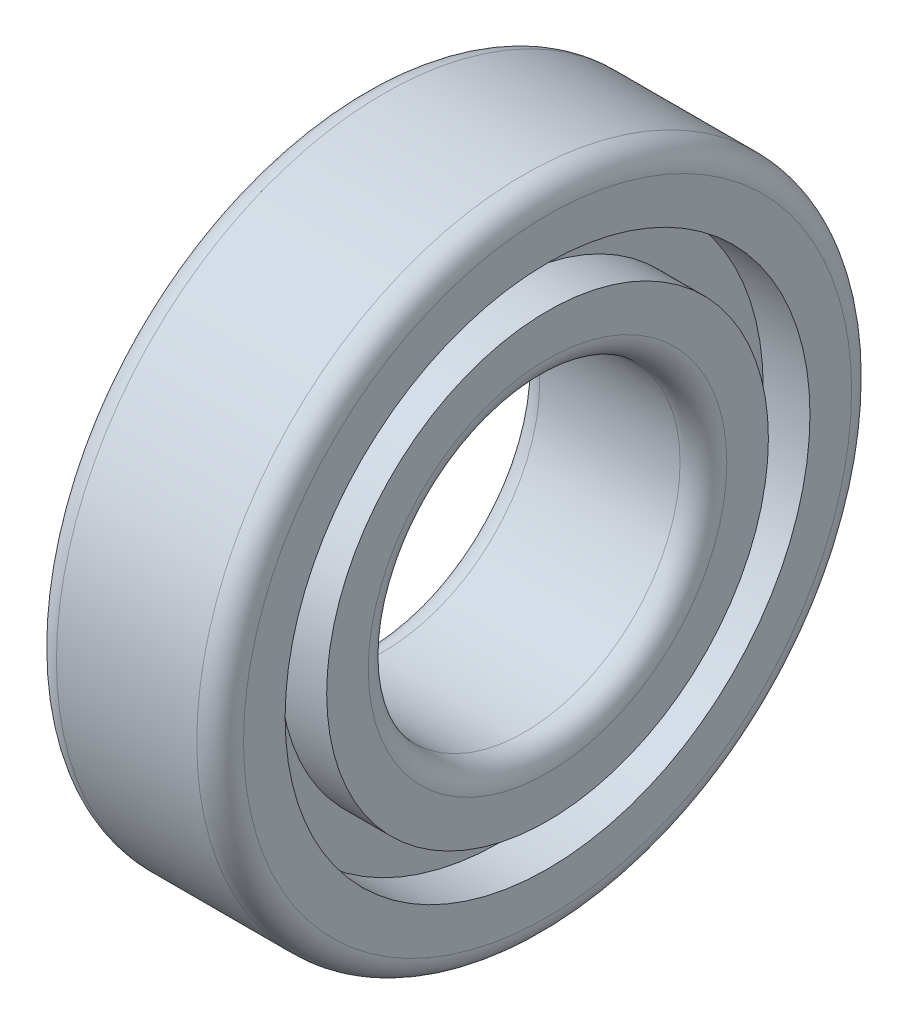
ISO-10303-21;
HEADER;
FILE_DESCRIPTION(('STEP AP214'),'2;1');
FILE_NAME('part.step','',(''),(''),'','','');
FILE_SCHEMA(('AUTOMOTIVE_DESIGN { 1 0 10303 214 1 1 1 1 }'));
ENDSEC;
DATA;
#1=APPLICATION_CONTEXT('core data for automotive mechanical design processes');
#2=APPLICATION_PROTOCOL_DEFINITION('international standard','automotive_design',2000,#1);
#3=PRODUCT_CONTEXT('',#1,'mechanical');
#4=PRODUCT('Part','Part','',(#3));
#5=PRODUCT_RELATED_PRODUCT_CATEGORY('part','',(#4));
#6=PRODUCT_DEFINITION_FORMATION('','',#4);
#7=PRODUCT_DEFINITION_CONTEXT('part definition',#1,'design');
#8=PRODUCT_DEFINITION('design','',#6,#7);
#9=PRODUCT_DEFINITION_SHAPE('','',#8);
#10=(LENGTH_UNIT() NAMED_UNIT(*) SI_UNIT(.MILLI.,.METRE.));
#11=(NAMED_UNIT(*) PLANE_ANGLE_UNIT() SI_UNIT($,.RADIAN.));
#12=(NAMED_UNIT(*) SI_UNIT($,.STERADIAN.) SOLID_ANGLE_UNIT());
#13=UNCERTAINTY_MEASURE_WITH_UNIT(LENGTH_MEASURE(1.E-05),#10,'distance_accuracy_value','');
#14=(GEOMETRIC_REPRESENTATION_CONTEXT(3) GLOBAL_UNCERTAINTY_ASSIGNED_CONTEXT((#13)) GLOBAL_UNIT_ASSIGNED_CONTEXT((#10,
#11,#12)) REPRESENTATION_CONTEXT('',''));
#15=CARTESIAN_POINT('',(0.,0.,0.));
#16=DIRECTION('',(0.,0.,1.));
#17=DIRECTION('',(1.,0.,0.));
#18=AXIS2_PLACEMENT_3D('',#15,#16,#17);
#19=CARTESIAN_POINT('',(-873.991742101089,0.,0.));
#20=DIRECTION('',(-1.,0.,0.));
#21=DIRECTION('',(0.,0.,1.));
#22=AXIS2_PLACEMENT_3D('',#19,#20,#21);
#23=CYLINDRICAL_SURFACE('',#22,14.1666666666667);
#24=CARTESIAN_POINT('',(-6.00000000000001,0.,0.));
#25=DIRECTION('',(-1.,0.,0.));
#26=DIRECTION('',(0.,0.,1.));
#27=AXIS2_PLACEMENT_3D('',#24,#25,#26);
#28=CIRCLE('',#27,14.1666666666667);
#29=CARTESIAN_POINT('',(-6.00000000000001,0.,14.1666666666667));
#30=VERTEX_POINT('',#29);
#31=EDGE_CURVE('E85',#30,#30,#28,.T.);
#32=ORIENTED_EDGE('',*,*,#31,.F.);
#33=EDGE_LOOP('',(#32));
#34=FACE_BOUND('',#33,.T.);
#35=CARTESIAN_POINT('',(-3.,0.,0.));
#36=DIRECTION('',(-1.,0.,0.));
#37=DIRECTION('',(0.,0.,1.));
#38=AXIS2_PLACEMENT_3D('',#35,#36,#37);
#39=CIRCLE('',#38,14.1666666666667);
#40=CARTESIAN_POINT('',(-3.,0.,14.1666666666667));
#41=VERTEX_POINT('',#40);
#42=EDGE_CURVE('E10',#41,#41,#39,.T.);
#43=ORIENTED_EDGE('',*,*,#42,.T.);
#44=EDGE_LOOP('',(#43));
#45=FACE_BOUND('',#44,.T.);
#46=ADVANCED_FACE('F33',(#34,#45),#23,.T.);
#47=CARTESIAN_POINT('',(-3.,14.1666666666667,0.));
#48=DIRECTION('',(1.,0.,0.));
#49=DIRECTION('',(0.,0.,-1.));
#50=AXIS2_PLACEMENT_3D('',#47,#48,#49);
#51=PLANE('',#50);
#52=ORIENTED_EDGE('',*,*,#42,.F.);
#53=EDGE_LOOP('',(#52));
#54=FACE_BOUND('',#53,.T.);
#55=CARTESIAN_POINT('',(-3.,0.,0.));
#56=DIRECTION('',(-1.,0.,0.));
#57=DIRECTION('',(0.,0.,1.));
#58=AXIS2_PLACEMENT_3D('',#55,#56,#57);
#59=CIRCLE('',#58,16.8333333333333);
#60=CARTESIAN_POINT('',(-3.,0.,16.8333333333333));
#61=VERTEX_POINT('',#60);
#62=EDGE_CURVE('E39',#61,#61,#59,.T.);
#63=ORIENTED_EDGE('',*,*,#62,.T.);
#64=EDGE_LOOP('',(#63));
#65=FACE_BOUND('',#64,.T.);
#66=ADVANCED_FACE('F92',(#54,#65),#51,.F.);
#67=CARTESIAN_POINT('',(-873.991742101089,0.,0.));
#68=DIRECTION('',(-1.,0.,0.));
#69=DIRECTION('',(0.,0.,1.));
#70=AXIS2_PLACEMENT_3D('',#67,#68,#69);
#71=CYLINDRICAL_SURFACE('',#70,16.8333333333333);
#72=ORIENTED_EDGE('',*,*,#62,.F.);
#73=EDGE_LOOP('',(#72));
#74=FACE_BOUND('',#73,.T.);
#75=CARTESIAN_POINT('',(-6.00000000000001,0.,0.));
#76=DIRECTION('',(-1.,0.,0.));
#77=DIRECTION('',(0.,0.,1.));
#78=AXIS2_PLACEMENT_3D('',#75,#76,#77);
#79=CIRCLE('',#78,16.8333333333333);
#80=CARTESIAN_POINT('',(-6.00000000000001,0.,16.8333333333333));
#81=VERTEX_POINT('',#80);
#82=EDGE_CURVE('E43',#81,#81,#79,.T.);
#83=ORIENTED_EDGE('',*,*,#82,.T.);
#84=EDGE_LOOP('',(#83));
#85=FACE_BOUND('',#84,.T.);
#86=ADVANCED_FACE('F96',(#74,#85),#71,.F.);
#87=CARTESIAN_POINT('',(-6.,16.8333333333333,0.));
#88=DIRECTION('',(1.,0.,0.));
#89=DIRECTION('',(0.,0.,-1.));
#90=AXIS2_PLACEMENT_3D('',#87,#88,#89);
#91=PLANE('',#90);
#92=ORIENTED_EDGE('',*,*,#82,.F.);
#93=EDGE_LOOP('',(#92));
#94=FACE_BOUND('',#93,.T.);
#95=CARTESIAN_POINT('',(-6.00000000000001,0.,0.));
#96=DIRECTION('',(-1.,0.,0.));
#97=DIRECTION('',(0.,0.,1.));
#98=AXIS2_PLACEMENT_3D('',#95,#96,#97);
#99=CIRCLE('',#98,19.5);
#100=CARTESIAN_POINT('',(-6.00000000000001,0.,19.5));
#101=VERTEX_POINT('',#100);
#102=EDGE_CURVE('E47',#101,#101,#99,.T.);
#103=ORIENTED_EDGE('',*,*,#102,.T.);
#104=EDGE_LOOP('',(#103));
#105=FACE_BOUND('',#104,.T.);
#106=ADVANCED_FACE('F101',(#94,#105),#91,.F.);
#107=CARTESIAN_POINT('',(-4.5,0.,0.));
#108=DIRECTION('',(-1.,0.,0.));
#109=DIRECTION('',(0.,0.,1.));
#110=AXIS2_PLACEMENT_3D('',#107,#108,#109);
#111=TOROIDAL_SURFACE('',#110,19.5,1.5);
#112=ORIENTED_EDGE('',*,*,#102,.F.);
#113=EDGE_LOOP('',(#112));
#114=FACE_BOUND('',#113,.T.);
#115=CARTESIAN_POINT('',(-4.49999999999995,0.,0.));
#116=DIRECTION('',(-1.,0.,0.));
#117=DIRECTION('',(0.,0.,1.));
#118=AXIS2_PLACEMENT_3D('',#115,#116,#117);
#119=CIRCLE('',#118,21.);
#120=CARTESIAN_POINT('',(-4.49999999999995,0.,21.));
#121=VERTEX_POINT('',#120);
#122=EDGE_CURVE('E52',#121,#121,#119,.T.);
#123=ORIENTED_EDGE('',*,*,#122,.T.);
#124=EDGE_LOOP('',(#123));
#125=FACE_BOUND('',#124,.T.);
#126=ADVANCED_FACE('F107',(#114,#125),#111,.T.);
#127=CARTESIAN_POINT('',(-873.991742101089,0.,0.));
#128=DIRECTION('',(-1.,0.,0.));
#129=DIRECTION('',(0.,0.,1.));
#130=AXIS2_PLACEMENT_3D('',#127,#128,#129);
#131=CYLINDRICAL_SURFACE('',#130,21.);
#132=ORIENTED_EDGE('',*,*,#122,.F.);
#133=EDGE_LOOP('',(#132));
#134=FACE_BOUND('',#133,.T.);
#135=CARTESIAN_POINT('',(4.49999999999995,0.,0.));
#136=DIRECTION('',(-1.,0.,0.));
#137=DIRECTION('',(0.,0.,1.));
#138=AXIS2_PLACEMENT_3D('',#135,#136,#137);
#139=CIRCLE('',#138,21.);
#140=CARTESIAN_POINT('',(4.49999999999995,0.,21.));
#141=VERTEX_POINT('',#140);
#142=EDGE_CURVE('E55',#141,#141,#139,.T.);
#143=ORIENTED_EDGE('',*,*,#142,.T.);
#144=EDGE_LOOP('',(#143));
#145=FACE_BOUND('',#144,.T.);
#146=ADVANCED_FACE('F111',(#134,#145),#131,.T.);
#147=CARTESIAN_POINT('',(4.5,0.,0.));
#148=DIRECTION('',(-1.,0.,0.));
#149=DIRECTION('',(0.,0.,1.));
#150=AXIS2_PLACEMENT_3D('',#147,#148,#149);
#151=TOROIDAL_SURFACE('',#150,19.5,1.5);
#152=ORIENTED_EDGE('',*,*,#142,.F.);
#153=EDGE_LOOP('',(#152));
#154=FACE_BOUND('',#153,.T.);
#155=CARTESIAN_POINT('',(6.00000000000001,0.,0.));
#156=DIRECTION('',(-1.,0.,0.));
#157=DIRECTION('',(0.,0.,1.));
#158=AXIS2_PLACEMENT_3D('',#155,#156,#157);
#159=CIRCLE('',#158,19.5);
#160=CARTESIAN_POINT('',(6.00000000000001,0.,19.5));
#161=VERTEX_POINT('',#160);
#162=EDGE_CURVE('E58',#161,#161,#159,.T.);
#163=ORIENTED_EDGE('',*,*,#162,.T.);
#164=EDGE_LOOP('',(#163));
#165=FACE_BOUND('',#164,.T.);
#166=ADVANCED_FACE('F115',(#154,#165),#151,.T.);
#167=CARTESIAN_POINT('',(6.,16.8333333333333,0.));
#168=DIRECTION('',(-1.,0.,0.));
#169=DIRECTION('',(0.,0.,1.));
#170=AXIS2_PLACEMENT_3D('',#167,#168,#169);
#171=PLANE('',#170);
#172=ORIENTED_EDGE('',*,*,#162,.F.);
#173=EDGE_LOOP('',(#172));
#174=FACE_BOUND('',#173,.T.);
#175=CARTESIAN_POINT('',(6.00000000000001,0.,0.));
#176=DIRECTION('',(-1.,0.,0.));
#177=DIRECTION('',(0.,0.,1.));
#178=AXIS2_PLACEMENT_3D('',#175,#176,#177);
#179=CIRCLE('',#178,16.8333333333333);
#180=CARTESIAN_POINT('',(6.00000000000001,0.,16.8333333333333));
#181=VERTEX_POINT('',#180);
#182=EDGE_CURVE('E61',#181,#181,#179,.T.);
#183=ORIENTED_EDGE('',*,*,#182,.T.);
#184=EDGE_LOOP('',(#183));
#185=FACE_BOUND('',#184,.T.);
#186=ADVANCED_FACE('F119',(#174,#185),#171,.F.);
#187=CARTESIAN_POINT('',(-873.991742101089,0.,0.));
#188=DIRECTION('',(-1.,0.,0.));
#189=DIRECTION('',(0.,0.,1.));
#190=AXIS2_PLACEMENT_3D('',#187,#188,#189);
#191=CYLINDRICAL_SURFACE('',#190,16.8333333333333);
#192=ORIENTED_EDGE('',*,*,#182,.F.);
#193=EDGE_LOOP('',(#192));
#194=FACE_BOUND('',#193,.T.);
#195=CARTESIAN_POINT('',(3.,0.,0.));
#196=DIRECTION('',(-1.,0.,0.));
#197=DIRECTION('',(0.,0.,1.));
#198=AXIS2_PLACEMENT_3D('',#195,#196,#197);
#199=CIRCLE('',#198,16.8333333333333);
#200=CARTESIAN_POINT('',(3.,0.,16.8333333333333));
#201=VERTEX_POINT('',#200);
#202=EDGE_CURVE('E64',#201,#201,#199,.T.);
#203=ORIENTED_EDGE('',*,*,#202,.T.);
#204=EDGE_LOOP('',(#203));
#205=FACE_BOUND('',#204,.T.);
#206=ADVANCED_FACE('F123',(#194,#205),#191,.F.);
#207=CARTESIAN_POINT('',(3.,14.1666666666667,0.));
#208=DIRECTION('',(-1.,0.,0.));
#209=DIRECTION('',(0.,0.,1.));
#210=AXIS2_PLACEMENT_3D('',#207,#208,#209);
#211=PLANE('',#210);
#212=ORIENTED_EDGE('',*,*,#202,.F.);
#213=EDGE_LOOP('',(#212));
#214=FACE_BOUND('',#213,.T.);
#215=CARTESIAN_POINT('',(3.,0.,0.));
#216=DIRECTION('',(-1.,0.,0.));
#217=DIRECTION('',(0.,0.,1.));
#218=AXIS2_PLACEMENT_3D('',#215,#216,#217);
#219=CIRCLE('',#218,14.1666666666667);
#220=CARTESIAN_POINT('',(3.,0.,14.1666666666667));
#221=VERTEX_POINT('',#220);
#222=EDGE_CURVE('E67',#221,#221,#219,.T.);
#223=ORIENTED_EDGE('',*,*,#222,.T.);
#224=EDGE_LOOP('',(#223));
#225=FACE_BOUND('',#224,.T.);
#226=ADVANCED_FACE('F127',(#214,#225),#211,.F.);
#227=CARTESIAN_POINT('',(-873.991742101089,0.,0.));
#228=DIRECTION('',(-1.,0.,0.));
#229=DIRECTION('',(0.,0.,1.));
#230=AXIS2_PLACEMENT_3D('',#227,#228,#229);
#231=CYLINDRICAL_SURFACE('',#230,14.1666666666667);
#232=ORIENTED_EDGE('',*,*,#222,.F.);
#233=EDGE_LOOP('',(#232));
#234=FACE_BOUND('',#233,.T.);
#235=CARTESIAN_POINT('',(6.00000000000001,0.,0.));
#236=DIRECTION('',(-1.,0.,0.));
#237=DIRECTION('',(0.,0.,1.));
#238=AXIS2_PLACEMENT_3D('',#235,#236,#237);
#239=CIRCLE('',#238,14.1666666666667);
#240=CARTESIAN_POINT('',(6.00000000000001,0.,14.1666666666667));
#241=VERTEX_POINT('',#240);
#242=EDGE_CURVE('E70',#241,#241,#239,.T.);
#243=ORIENTED_EDGE('',*,*,#242,.T.);
#244=EDGE_LOOP('',(#243));
#245=FACE_BOUND('',#244,.T.);
#246=ADVANCED_FACE('F131',(#234,#245),#231,.T.);
#247=CARTESIAN_POINT('',(6.,11.5,0.));
#248=DIRECTION('',(-1.,0.,0.));
#249=DIRECTION('',(0.,0.,1.));
#250=AXIS2_PLACEMENT_3D('',#247,#248,#249);
#251=PLANE('',#250);
#252=ORIENTED_EDGE('',*,*,#242,.F.);
#253=EDGE_LOOP('',(#252));
#254=FACE_BOUND('',#253,.T.);
#255=CARTESIAN_POINT('',(6.00000000000001,0.,0.));
#256=DIRECTION('',(-1.,0.,0.));
#257=DIRECTION('',(0.,0.,1.));
#258=AXIS2_PLACEMENT_3D('',#255,#256,#257);
#259=CIRCLE('',#258,11.5);
#260=CARTESIAN_POINT('',(6.00000000000001,0.,11.5));
#261=VERTEX_POINT('',#260);
#262=EDGE_CURVE('E73',#261,#261,#259,.T.);
#263=ORIENTED_EDGE('',*,*,#262,.T.);
#264=EDGE_LOOP('',(#263));
#265=FACE_BOUND('',#264,.T.);
#266=ADVANCED_FACE('F135',(#254,#265),#251,.F.);
#267=CARTESIAN_POINT('',(4.5,0.,0.));
#268=DIRECTION('',(-1.,0.,0.));
#269=DIRECTION('',(0.,0.,1.));
#270=AXIS2_PLACEMENT_3D('',#267,#268,#269);
#271=TOROIDAL_SURFACE('',#270,11.5,1.5);
#272=ORIENTED_EDGE('',*,*,#262,.F.);
#273=EDGE_LOOP('',(#272));
#274=FACE_BOUND('',#273,.T.);
#275=CARTESIAN_POINT('',(4.49999999999995,0.,0.));
#276=DIRECTION('',(-1.,0.,0.));
#277=DIRECTION('',(0.,0.,1.));
#278=AXIS2_PLACEMENT_3D('',#275,#276,#277);
#279=CIRCLE('',#278,10.);
#280=CARTESIAN_POINT('',(4.49999999999995,0.,10.));
#281=VERTEX_POINT('',#280);
#282=EDGE_CURVE('E76',#281,#281,#279,.T.);
#283=ORIENTED_EDGE('',*,*,#282,.T.);
#284=EDGE_LOOP('',(#283));
#285=FACE_BOUND('',#284,.T.);
#286=ADVANCED_FACE('F139',(#274,#285),#271,.T.);
#287=CARTESIAN_POINT('',(-873.991742101089,0.,0.));
#288=DIRECTION('',(-1.,0.,0.));
#289=DIRECTION('',(0.,0.,1.));
#290=AXIS2_PLACEMENT_3D('',#287,#288,#289);
#291=CYLINDRICAL_SURFACE('',#290,10.);
#292=ORIENTED_EDGE('',*,*,#282,.F.);
#293=EDGE_LOOP('',(#292));
#294=FACE_BOUND('',#293,.T.);
#295=CARTESIAN_POINT('',(-4.49999999999995,0.,0.));
#296=DIRECTION('',(-1.,0.,0.));
#297=DIRECTION('',(0.,0.,1.));
#298=AXIS2_PLACEMENT_3D('',#295,#296,#297);
#299=CIRCLE('',#298,10.);
#300=CARTESIAN_POINT('',(-4.49999999999995,0.,10.));
#301=VERTEX_POINT('',#300);
#302=EDGE_CURVE('E79',#301,#301,#299,.T.);
#303=ORIENTED_EDGE('',*,*,#302,.T.);
#304=EDGE_LOOP('',(#303));
#305=FACE_BOUND('',#304,.T.);
#306=ADVANCED_FACE('F143',(#294,#305),#291,.F.);
#307=CARTESIAN_POINT('',(-4.5,0.,0.));
#308=DIRECTION('',(-1.,0.,0.));
#309=DIRECTION('',(0.,0.,1.));
#310=AXIS2_PLACEMENT_3D('',#307,#308,#309);
#311=TOROIDAL_SURFACE('',#310,11.5,1.5);
#312=ORIENTED_EDGE('',*,*,#302,.F.);
#313=EDGE_LOOP('',(#312));
#314=FACE_BOUND('',#313,.T.);
#315=CARTESIAN_POINT('',(-6.00000000000001,0.,0.));
#316=DIRECTION('',(-1.,0.,0.));
#317=DIRECTION('',(0.,0.,1.));
#318=AXIS2_PLACEMENT_3D('',#315,#316,#317);
#319=CIRCLE('',#318,11.5);
#320=CARTESIAN_POINT('',(-6.00000000000001,0.,11.5));
#321=VERTEX_POINT('',#320);
#322=EDGE_CURVE('E82',#321,#321,#319,.T.);
#323=ORIENTED_EDGE('',*,*,#322,.T.);
#324=EDGE_LOOP('',(#323));
#325=FACE_BOUND('',#324,.T.);
#326=ADVANCED_FACE('F147',(#314,#325),#311,.T.);
#327=CARTESIAN_POINT('',(-6.,11.5,0.));
#328=DIRECTION('',(1.,0.,0.));
#329=DIRECTION('',(0.,0.,-1.));
#330=AXIS2_PLACEMENT_3D('',#327,#328,#329);
#331=PLANE('',#330);
#332=ORIENTED_EDGE('',*,*,#322,.F.);
#333=EDGE_LOOP('',(#332));
#334=FACE_BOUND('',#333,.T.);
#335=ORIENTED_EDGE('',*,*,#31,.T.);
#336=EDGE_LOOP('',(#335));
#337=FACE_BOUND('',#336,.T.);
#338=ADVANCED_FACE('F89',(#334,#337),#331,.F.);
#339=CLOSED_SHELL('',(#46,#66,#86,#106,#126,#146,#166,#186,#206,#226,#246,#266,#286,#306,#326,#338));
#340=MANIFOLD_SOLID_BREP('B2',#339);
#341=ADVANCED_BREP_SHAPE_REPRESENTATION('',(#18,#340),#14);
#342=SHAPE_DEFINITION_REPRESENTATION(#9,#341);
ENDSEC;
END-ISO-10303-21;
